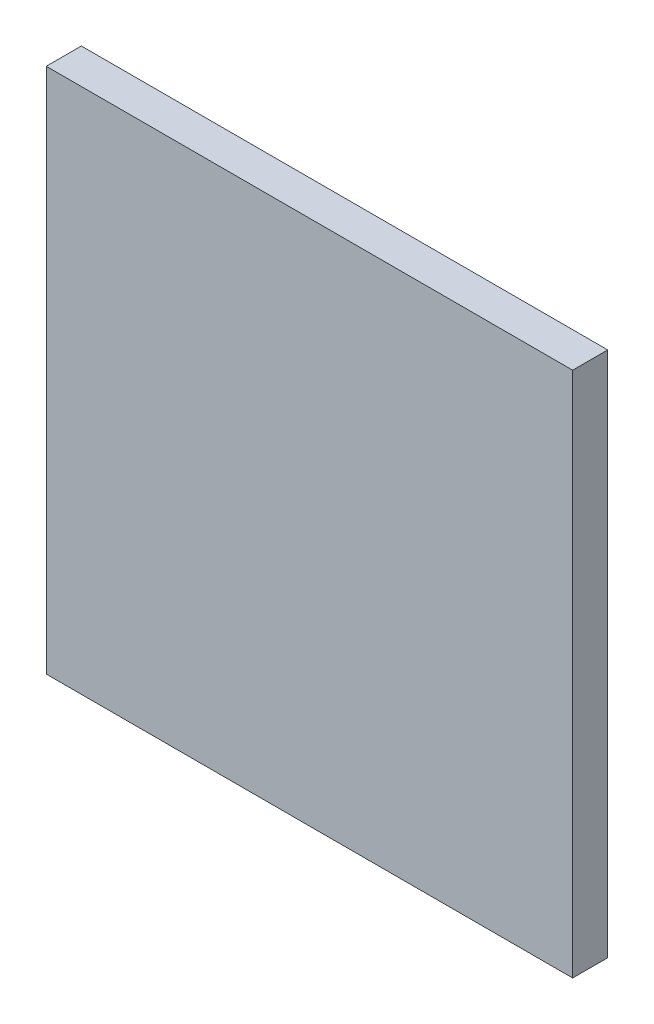
ISO-10303-21;
HEADER;
FILE_DESCRIPTION(('STEP AP214'),'2;1');
FILE_NAME('part.step','',(''),(''),'','','');
FILE_SCHEMA(('AUTOMOTIVE_DESIGN { 1 0 10303 214 1 1 1 1 }'));
ENDSEC;
DATA;
#1=APPLICATION_CONTEXT('core data for automotive mechanical design processes');
#2=APPLICATION_PROTOCOL_DEFINITION('international standard','automotive_design',2000,#1);
#3=PRODUCT_CONTEXT('',#1,'mechanical');
#4=PRODUCT('Part','Part','',(#3));
#5=PRODUCT_RELATED_PRODUCT_CATEGORY('part','',(#4));
#6=PRODUCT_DEFINITION_FORMATION('','',#4);
#7=PRODUCT_DEFINITION_CONTEXT('part definition',#1,'design');
#8=PRODUCT_DEFINITION('design','',#6,#7);
#9=PRODUCT_DEFINITION_SHAPE('','',#8);
#10=(LENGTH_UNIT() NAMED_UNIT(*) SI_UNIT(.MILLI.,.METRE.));
#11=(NAMED_UNIT(*) PLANE_ANGLE_UNIT() SI_UNIT($,.RADIAN.));
#12=(NAMED_UNIT(*) SI_UNIT($,.STERADIAN.) SOLID_ANGLE_UNIT());
#13=UNCERTAINTY_MEASURE_WITH_UNIT(LENGTH_MEASURE(1.E-05),#10,'distance_accuracy_value','');
#14=(GEOMETRIC_REPRESENTATION_CONTEXT(3) GLOBAL_UNCERTAINTY_ASSIGNED_CONTEXT((#13)) GLOBAL_UNIT_ASSIGNED_CONTEXT((#10,
#11,#12)) REPRESENTATION_CONTEXT('',''));
#15=CARTESIAN_POINT('',(0.,0.,0.));
#16=DIRECTION('',(0.,0.,1.));
#17=DIRECTION('',(1.,0.,0.));
#18=AXIS2_PLACEMENT_3D('',#15,#16,#17);
#19=CARTESIAN_POINT('',(150.,-150.,-20.));
#20=DIRECTION('',(1.,0.,0.));
#21=DIRECTION('',(0.,0.,-1.));
#22=AXIS2_PLACEMENT_3D('',#19,#20,#21);
#23=PLANE('',#22);
#24=DIRECTION('',(0.,1.,0.));
#25=VECTOR('',#24,1.);
#26=CARTESIAN_POINT('',(150.,-150.,0.));
#27=LINE('',#26,#25);
#28=CARTESIAN_POINT('',(150.,-150.,0.));
#29=VERTEX_POINT('',#28);
#30=CARTESIAN_POINT('',(150.,150.,0.));
#31=VERTEX_POINT('',#30);
#32=EDGE_CURVE('E98',#29,#31,#27,.T.);
#33=ORIENTED_EDGE('',*,*,#32,.F.);
#34=DIRECTION('',(0.,0.,1.));
#35=VECTOR('',#34,1.);
#36=CARTESIAN_POINT('',(150.,-150.,-20.));
#37=LINE('',#36,#35);
#38=CARTESIAN_POINT('',(150.,-150.,-20.));
#39=VERTEX_POINT('',#38);
#40=EDGE_CURVE('E11',#39,#29,#37,.T.);
#41=ORIENTED_EDGE('',*,*,#40,.F.);
#42=DIRECTION('',(0.,1.,0.));
#43=VECTOR('',#42,1.);
#44=CARTESIAN_POINT('',(150.,-150.,-20.));
#45=LINE('',#44,#43);
#46=CARTESIAN_POINT('',(150.,150.,-20.));
#47=VERTEX_POINT('',#46);
#48=EDGE_CURVE('E92',#39,#47,#45,.T.);
#49=ORIENTED_EDGE('',*,*,#48,.T.);
#50=DIRECTION('',(0.,0.,1.));
#51=VECTOR('',#50,1.);
#52=CARTESIAN_POINT('',(150.,150.,-20.));
#53=LINE('',#52,#51);
#54=EDGE_CURVE('E37',#47,#31,#53,.T.);
#55=ORIENTED_EDGE('',*,*,#54,.T.);
#56=EDGE_LOOP('',(#33,#41,#49,#55));
#57=FACE_BOUND('',#56,.T.);
#58=ADVANCED_FACE('F34',(#57),#23,.T.);
#59=CARTESIAN_POINT('',(-150.,-150.,-20.));
#60=DIRECTION('',(0.,-1.,0.));
#61=DIRECTION('',(0.,0.,-1.));
#62=AXIS2_PLACEMENT_3D('',#59,#60,#61);
#63=PLANE('',#62);
#64=DIRECTION('',(1.,0.,0.));
#65=VECTOR('',#64,1.);
#66=CARTESIAN_POINT('',(-150.,-150.,0.));
#67=LINE('',#66,#65);
#68=CARTESIAN_POINT('',(-150.,-150.,0.));
#69=VERTEX_POINT('',#68);
#70=EDGE_CURVE('E94',#69,#29,#67,.T.);
#71=ORIENTED_EDGE('',*,*,#70,.F.);
#72=DIRECTION('',(0.,0.,1.));
#73=VECTOR('',#72,1.);
#74=CARTESIAN_POINT('',(-150.,-150.,-20.));
#75=LINE('',#74,#73);
#76=CARTESIAN_POINT('',(-150.,-150.,-20.));
#77=VERTEX_POINT('',#76);
#78=EDGE_CURVE('E43',#77,#69,#75,.T.);
#79=ORIENTED_EDGE('',*,*,#78,.F.);
#80=DIRECTION('',(1.,0.,0.));
#81=VECTOR('',#80,1.);
#82=CARTESIAN_POINT('',(-150.,-150.,-20.));
#83=LINE('',#82,#81);
#84=EDGE_CURVE('E89',#77,#39,#83,.T.);
#85=ORIENTED_EDGE('',*,*,#84,.T.);
#86=ORIENTED_EDGE('',*,*,#40,.T.);
#87=EDGE_LOOP('',(#71,#79,#85,#86));
#88=FACE_BOUND('',#87,.T.);
#89=ADVANCED_FACE('F108',(#88),#63,.T.);
#90=CARTESIAN_POINT('',(-150.,-150.,-20.));
#91=DIRECTION('',(-1.,0.,0.));
#92=DIRECTION('',(0.,0.,1.));
#93=AXIS2_PLACEMENT_3D('',#90,#91,#92);
#94=PLANE('',#93);
#95=DIRECTION('',(0.,-1.,0.));
#96=VECTOR('',#95,1.);
#97=CARTESIAN_POINT('',(-150.,-150.,0.));
#98=LINE('',#97,#96);
#99=CARTESIAN_POINT('',(-150.,150.,0.));
#100=VERTEX_POINT('',#99);
#101=EDGE_CURVE('E84',#100,#69,#98,.T.);
#102=ORIENTED_EDGE('',*,*,#101,.F.);
#103=DIRECTION('',(0.,0.,1.));
#104=VECTOR('',#103,1.);
#105=CARTESIAN_POINT('',(-150.,150.,-20.));
#106=LINE('',#105,#104);
#107=CARTESIAN_POINT('',(-150.,150.,-20.));
#108=VERTEX_POINT('',#107);
#109=EDGE_CURVE('E79',#108,#100,#106,.T.);
#110=ORIENTED_EDGE('',*,*,#109,.F.);
#111=DIRECTION('',(0.,-1.,0.));
#112=VECTOR('',#111,1.);
#113=CARTESIAN_POINT('',(-150.,-150.,-20.));
#114=LINE('',#113,#112);
#115=EDGE_CURVE('E82',#108,#77,#114,.T.);
#116=ORIENTED_EDGE('',*,*,#115,.T.);
#117=ORIENTED_EDGE('',*,*,#78,.T.);
#118=EDGE_LOOP('',(#102,#110,#116,#117));
#119=FACE_BOUND('',#118,.T.);
#120=ADVANCED_FACE('F81',(#119),#94,.T.);
#121=CARTESIAN_POINT('',(-150.,150.,-20.));
#122=DIRECTION('',(0.,1.,0.));
#123=DIRECTION('',(0.,0.,1.));
#124=AXIS2_PLACEMENT_3D('',#121,#122,#123);
#125=PLANE('',#124);
#126=DIRECTION('',(-1.,0.,0.));
#127=VECTOR('',#126,1.);
#128=CARTESIAN_POINT('',(-150.,150.,0.));
#129=LINE('',#128,#127);
#130=EDGE_CURVE('E101',#31,#100,#129,.T.);
#131=ORIENTED_EDGE('',*,*,#130,.F.);
#132=ORIENTED_EDGE('',*,*,#54,.F.);
#133=DIRECTION('',(-1.,0.,0.));
#134=VECTOR('',#133,1.);
#135=CARTESIAN_POINT('',(-150.,150.,-20.));
#136=LINE('',#135,#134);
#137=EDGE_CURVE('E88',#47,#108,#136,.T.);
#138=ORIENTED_EDGE('',*,*,#137,.T.);
#139=ORIENTED_EDGE('',*,*,#109,.T.);
#140=EDGE_LOOP('',(#131,#132,#138,#139));
#141=FACE_BOUND('',#140,.T.);
#142=ADVANCED_FACE('F91',(#141),#125,.T.);
#143=CARTESIAN_POINT('',(0.,0.,-20.));
#144=DIRECTION('',(0.,0.,-1.));
#145=DIRECTION('',(-1.,0.,0.));
#146=AXIS2_PLACEMENT_3D('',#143,#144,#145);
#147=PLANE('',#146);
#148=ORIENTED_EDGE('',*,*,#48,.F.);
#149=ORIENTED_EDGE('',*,*,#84,.F.);
#150=ORIENTED_EDGE('',*,*,#115,.F.);
#151=ORIENTED_EDGE('',*,*,#137,.F.);
#152=EDGE_LOOP('',(#148,#149,#150,#151));
#153=FACE_BOUND('',#152,.T.);
#154=ADVANCED_FACE('F87',(#153),#147,.T.);
#155=CARTESIAN_POINT('',(0.,0.,0.));
#156=DIRECTION('',(0.,0.,-1.));
#157=DIRECTION('',(-1.,0.,0.));
#158=AXIS2_PLACEMENT_3D('',#155,#156,#157);
#159=PLANE('',#158);
#160=ORIENTED_EDGE('',*,*,#32,.T.);
#161=ORIENTED_EDGE('',*,*,#130,.T.);
#162=ORIENTED_EDGE('',*,*,#101,.T.);
#163=ORIENTED_EDGE('',*,*,#70,.T.);
#164=EDGE_LOOP('',(#160,#161,#162,#163));
#165=FACE_BOUND('',#164,.T.);
#166=ADVANCED_FACE('F107',(#165),#159,.F.);
#167=CLOSED_SHELL('',(#58,#89,#120,#142,#154,#166));
#168=MANIFOLD_SOLID_BREP('B2',#167);
#169=ADVANCED_BREP_SHAPE_REPRESENTATION('',(#18,#168),#14);
#170=SHAPE_DEFINITION_REPRESENTATION(#9,#169);
ENDSEC;
END-ISO-10303-21;
